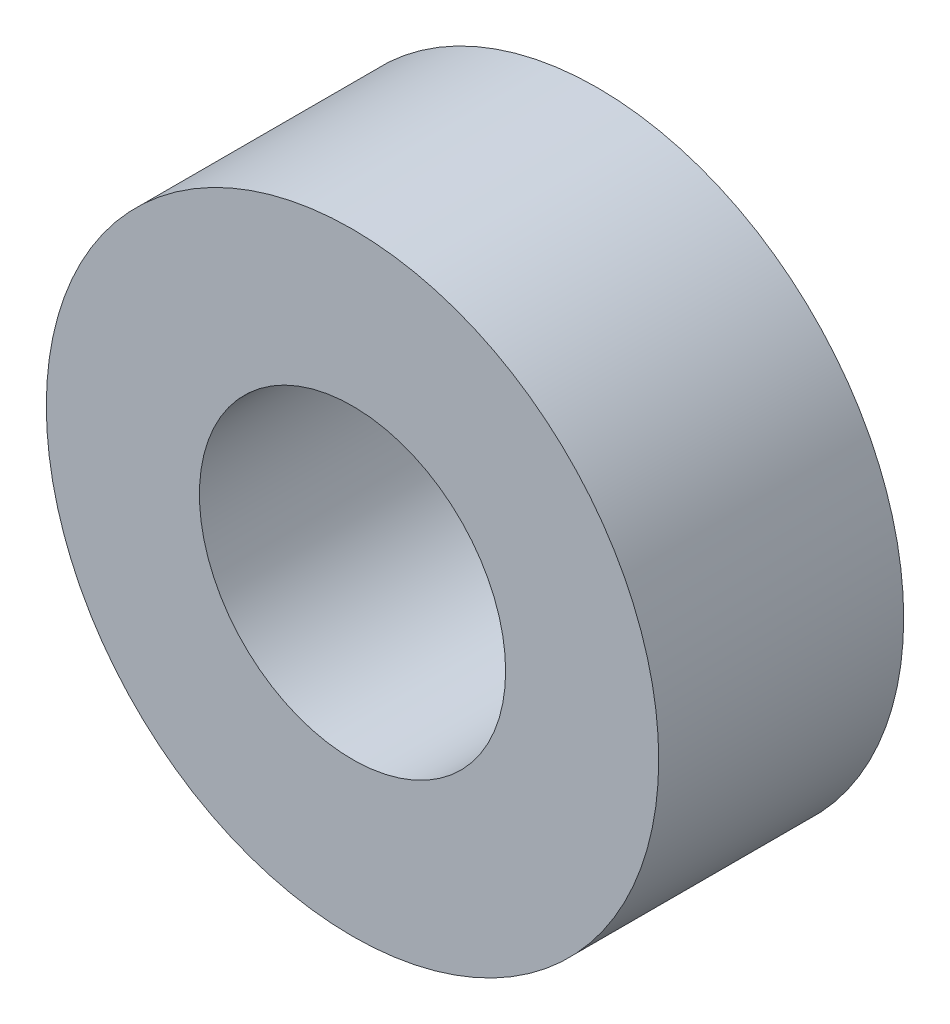
ISO-10303-21;
HEADER;
FILE_DESCRIPTION(('STEP AP214'),'2;1');
FILE_NAME('part.step','',(''),(''),'','','');
FILE_SCHEMA(('AUTOMOTIVE_DESIGN { 1 0 10303 214 1 1 1 1 }'));
ENDSEC;
DATA;
#1=APPLICATION_CONTEXT('core data for automotive mechanical design processes');
#2=APPLICATION_PROTOCOL_DEFINITION('international standard','automotive_design',2000,#1);
#3=PRODUCT_CONTEXT('',#1,'mechanical');
#4=PRODUCT('Part','Part','',(#3));
#5=PRODUCT_RELATED_PRODUCT_CATEGORY('part','',(#4));
#6=PRODUCT_DEFINITION_FORMATION('','',#4);
#7=PRODUCT_DEFINITION_CONTEXT('part definition',#1,'design');
#8=PRODUCT_DEFINITION('design','',#6,#7);
#9=PRODUCT_DEFINITION_SHAPE('','',#8);
#10=(LENGTH_UNIT() NAMED_UNIT(*) SI_UNIT(.MILLI.,.METRE.));
#11=(NAMED_UNIT(*) PLANE_ANGLE_UNIT() SI_UNIT($,.RADIAN.));
#12=(NAMED_UNIT(*) SI_UNIT($,.STERADIAN.) SOLID_ANGLE_UNIT());
#13=UNCERTAINTY_MEASURE_WITH_UNIT(LENGTH_MEASURE(1.E-05),#10,'distance_accuracy_value','');
#14=(GEOMETRIC_REPRESENTATION_CONTEXT(3) GLOBAL_UNCERTAINTY_ASSIGNED_CONTEXT((#13)) GLOBAL_UNIT_ASSIGNED_CONTEXT((#10,
#11,#12)) REPRESENTATION_CONTEXT('',''));
#15=CARTESIAN_POINT('',(0.,0.,0.));
#16=DIRECTION('',(0.,0.,1.));
#17=DIRECTION('',(1.,0.,0.));
#18=AXIS2_PLACEMENT_3D('',#15,#16,#17);
#19=CARTESIAN_POINT('',(-268.,-50.0000000000003,27.4999999999993));
#20=DIRECTION('',(0.,0.,0.999999999999997));
#21=DIRECTION('',(1.,0.,0.));
#22=AXIS2_PLACEMENT_3D('',#19,#20,#21);
#23=PLANE('',#22);
#24=CARTESIAN_POINT('',(-268.,-50.0000000000003,27.4999999999993));
#25=DIRECTION('',(0.,0.,0.999999999999997));
#26=DIRECTION('',(1.,0.,0.));
#27=AXIS2_PLACEMENT_3D('',#24,#25,#26);
#28=CIRCLE('',#27,25.);
#29=CARTESIAN_POINT('',(-243.,-50.0000000000003,27.4999999999993));
#30=VERTEX_POINT('',#29);
#31=EDGE_CURVE('E10',#30,#30,#28,.T.);
#32=ORIENTED_EDGE('',*,*,#31,.T.);
#33=EDGE_LOOP('',(#32));
#34=FACE_BOUND('',#33,.T.);
#35=CARTESIAN_POINT('',(-268.,-50.0000000000003,27.4999999999993));
#36=DIRECTION('',(0.,0.,0.999999999999997));
#37=DIRECTION('',(1.,0.,0.));
#38=AXIS2_PLACEMENT_3D('',#35,#36,#37);
#39=CIRCLE('',#38,12.5);
#40=CARTESIAN_POINT('',(-255.5,-50.0000000000003,27.4999999999993));
#41=VERTEX_POINT('',#40);
#42=EDGE_CURVE('E43',#41,#41,#39,.T.);
#43=ORIENTED_EDGE('',*,*,#42,.F.);
#44=EDGE_LOOP('',(#43));
#45=FACE_BOUND('',#44,.T.);
#46=ADVANCED_FACE('F32',(#34,#45),#23,.T.);
#47=CARTESIAN_POINT('',(-268.000000000001,-50.,7.49999999999929));
#48=DIRECTION('',(0.,0.,0.999999999999997));
#49=DIRECTION('',(1.,0.,0.));
#50=AXIS2_PLACEMENT_3D('',#47,#48,#49);
#51=PLANE('',#50);
#52=CARTESIAN_POINT('',(-268.000000000001,-50.,7.49999999999929));
#53=DIRECTION('',(0.,0.,0.999999999999997));
#54=DIRECTION('',(1.,0.,0.));
#55=AXIS2_PLACEMENT_3D('',#52,#53,#54);
#56=CIRCLE('',#55,25.);
#57=CARTESIAN_POINT('',(-243.,-50.,7.49999999999929));
#58=VERTEX_POINT('',#57);
#59=EDGE_CURVE('E36',#58,#58,#56,.T.);
#60=ORIENTED_EDGE('',*,*,#59,.F.);
#61=EDGE_LOOP('',(#60));
#62=FACE_BOUND('',#61,.T.);
#63=CARTESIAN_POINT('',(-268.000000000001,-50.,7.49999999999929));
#64=DIRECTION('',(0.,0.,0.999999999999997));
#65=DIRECTION('',(1.,0.,0.));
#66=AXIS2_PLACEMENT_3D('',#63,#64,#65);
#67=CIRCLE('',#66,12.5);
#68=CARTESIAN_POINT('',(-255.500000000001,-50.,7.49999999999929));
#69=VERTEX_POINT('',#68);
#70=EDGE_CURVE('E45',#69,#69,#67,.T.);
#71=ORIENTED_EDGE('',*,*,#70,.T.);
#72=EDGE_LOOP('',(#71));
#73=FACE_BOUND('',#72,.T.);
#74=ADVANCED_FACE('F55',(#62,#73),#51,.F.);
#75=CARTESIAN_POINT('',(-268.,-50.0000000000003,27.4999999999993));
#76=DIRECTION('',(0.,0.,-0.999999999999997));
#77=DIRECTION('',(-1.,0.,0.));
#78=AXIS2_PLACEMENT_3D('',#75,#76,#77);
#79=CYLINDRICAL_SURFACE('',#78,25.);
#80=ORIENTED_EDGE('',*,*,#31,.F.);
#81=EDGE_LOOP('',(#80));
#82=FACE_BOUND('',#81,.T.);
#83=ORIENTED_EDGE('',*,*,#59,.T.);
#84=EDGE_LOOP('',(#83));
#85=FACE_BOUND('',#84,.T.);
#86=ADVANCED_FACE('F34',(#82,#85),#79,.T.);
#87=CARTESIAN_POINT('',(-268.,-50.0000000000003,27.4999999999993));
#88=DIRECTION('',(0.,0.,-0.999999999999997));
#89=DIRECTION('',(-1.,0.,0.));
#90=AXIS2_PLACEMENT_3D('',#87,#88,#89);
#91=CYLINDRICAL_SURFACE('',#90,12.5);
#92=ORIENTED_EDGE('',*,*,#42,.T.);
#93=EDGE_LOOP('',(#92));
#94=FACE_BOUND('',#93,.T.);
#95=ORIENTED_EDGE('',*,*,#70,.F.);
#96=EDGE_LOOP('',(#95));
#97=FACE_BOUND('',#96,.T.);
#98=ADVANCED_FACE('F51',(#94,#97),#91,.F.);
#99=CLOSED_SHELL('',(#46,#74,#86,#98));
#100=MANIFOLD_SOLID_BREP('B2',#99);
#101=ADVANCED_BREP_SHAPE_REPRESENTATION('',(#18,#100),#14);
#102=SHAPE_DEFINITION_REPRESENTATION(#9,#101);
ENDSEC;
END-ISO-10303-21;
